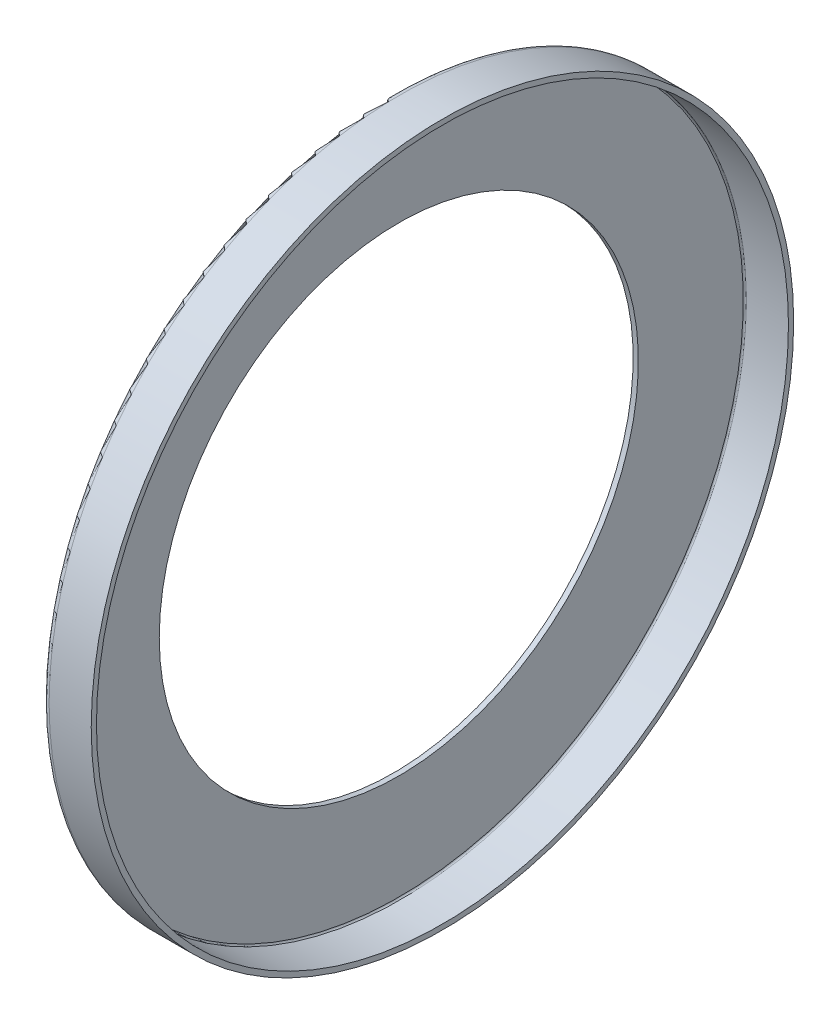
ISO-10303-21;
HEADER;
FILE_DESCRIPTION(('STEP AP214'),'2;1');
FILE_NAME('part.step','',(''),(''),'','','');
FILE_SCHEMA(('AUTOMOTIVE_DESIGN { 1 0 10303 214 1 1 1 1 }'));
ENDSEC;
DATA;
#1=APPLICATION_CONTEXT('core data for automotive mechanical design processes');
#2=APPLICATION_PROTOCOL_DEFINITION('international standard','automotive_design',2000,#1);
#3=PRODUCT_CONTEXT('',#1,'mechanical');
#4=PRODUCT('Part','Part','',(#3));
#5=PRODUCT_RELATED_PRODUCT_CATEGORY('part','',(#4));
#6=PRODUCT_DEFINITION_FORMATION('','',#4);
#7=PRODUCT_DEFINITION_CONTEXT('part definition',#1,'design');
#8=PRODUCT_DEFINITION('design','',#6,#7);
#9=PRODUCT_DEFINITION_SHAPE('','',#8);
#10=(LENGTH_UNIT() NAMED_UNIT(*) SI_UNIT(.MILLI.,.METRE.));
#11=(NAMED_UNIT(*) PLANE_ANGLE_UNIT() SI_UNIT($,.RADIAN.));
#12=(NAMED_UNIT(*) SI_UNIT($,.STERADIAN.) SOLID_ANGLE_UNIT());
#13=UNCERTAINTY_MEASURE_WITH_UNIT(LENGTH_MEASURE(1.E-05),#10,'distance_accuracy_value','');
#14=(GEOMETRIC_REPRESENTATION_CONTEXT(3) GLOBAL_UNCERTAINTY_ASSIGNED_CONTEXT((#13)) GLOBAL_UNIT_ASSIGNED_CONTEXT((#10,
#11,#12)) REPRESENTATION_CONTEXT('',''));
#15=CARTESIAN_POINT('',(0.,0.,0.));
#16=DIRECTION('',(0.,0.,1.));
#17=DIRECTION('',(1.,0.,0.));
#18=AXIS2_PLACEMENT_3D('',#15,#16,#17);
#19=CARTESIAN_POINT('',(-3.56875,0.,0.));
#20=DIRECTION('',(-1.,0.,0.));
#21=DIRECTION('',(0.,0.,1.));
#22=AXIS2_PLACEMENT_3D('',#19,#20,#21);
#23=CYLINDRICAL_SURFACE('',#22,15.82501);
#24=CARTESIAN_POINT('',(-3.39626,0.,0.));
#25=DIRECTION('',(1.,0.,0.));
#26=DIRECTION('',(0.,0.,1.));
#27=AXIS2_PLACEMENT_3D('',#24,#25,#26);
#28=CIRCLE('',#27,15.82501);
#29=CARTESIAN_POINT('',(-3.39626,0.,15.82501));
#30=VERTEX_POINT('',#29);
#31=EDGE_CURVE('E11',#30,#30,#28,.T.);
#32=ORIENTED_EDGE('',*,*,#31,.T.);
#33=EDGE_LOOP('',(#32));
#34=FACE_BOUND('',#33,.T.);
#35=CARTESIAN_POINT('',(-3.74124,0.,0.));
#36=DIRECTION('',(1.,0.,0.));
#37=DIRECTION('',(0.,0.,1.));
#38=AXIS2_PLACEMENT_3D('',#35,#36,#37);
#39=CIRCLE('',#38,15.82501);
#40=CARTESIAN_POINT('',(-3.74124,0.,15.82501));
#41=VERTEX_POINT('',#40);
#42=EDGE_CURVE('E62',#41,#41,#39,.T.);
#43=ORIENTED_EDGE('',*,*,#42,.F.);
#44=EDGE_LOOP('',(#43));
#45=FACE_BOUND('',#44,.T.);
#46=ADVANCED_FACE('F16',(#34,#45),#23,.F.);
#47=CARTESIAN_POINT('',(-3.39626,0.,19.2905056));
#48=DIRECTION('',(1.,0.,0.));
#49=DIRECTION('',(0.,0.,1.));
#50=AXIS2_PLACEMENT_3D('',#47,#48,#49);
#51=PLANE('',#50);
#52=CARTESIAN_POINT('',(-3.39626,0.,0.));
#53=DIRECTION('',(1.,0.,0.));
#54=DIRECTION('',(0.,0.,1.));
#55=AXIS2_PLACEMENT_3D('',#52,#53,#54);
#56=CIRCLE('',#55,22.7560012);
#57=CARTESIAN_POINT('',(-3.39626,0.,22.7560012));
#58=VERTEX_POINT('',#57);
#59=EDGE_CURVE('E25',#58,#58,#56,.T.);
#60=ORIENTED_EDGE('',*,*,#59,.T.);
#61=EDGE_LOOP('',(#60));
#62=FACE_BOUND('',#61,.T.);
#63=ORIENTED_EDGE('',*,*,#31,.F.);
#64=EDGE_LOOP('',(#63));
#65=FACE_BOUND('',#64,.T.);
#66=ADVANCED_FACE('F84',(#62,#65),#51,.T.);
#67=CARTESIAN_POINT('',(-3.296251,0.,0.));
#68=DIRECTION('',(1.,0.,0.));
#69=DIRECTION('',(0.,1.,0.));
#70=AXIS2_PLACEMENT_3D('',#67,#68,#69);
#71=TOROIDAL_SURFACE('',#70,22.7560012,0.100009);
#72=CARTESIAN_POINT('',(-3.296251,0.,0.));
#73=DIRECTION('',(1.,0.,0.));
#74=DIRECTION('',(0.,0.,1.));
#75=AXIS2_PLACEMENT_3D('',#72,#73,#74);
#76=CIRCLE('',#75,22.8560102);
#77=CARTESIAN_POINT('',(-3.296251,0.,22.8560102));
#78=VERTEX_POINT('',#77);
#79=EDGE_CURVE('E54',#78,#78,#76,.T.);
#80=ORIENTED_EDGE('',*,*,#79,.T.);
#81=EDGE_LOOP('',(#80));
#82=FACE_BOUND('',#81,.T.);
#83=ORIENTED_EDGE('',*,*,#59,.F.);
#84=EDGE_LOOP('',(#83));
#85=FACE_BOUND('',#84,.T.);
#86=ADVANCED_FACE('F55',(#82,#85),#71,.F.);
#87=CARTESIAN_POINT('',(-1.9052725,0.,0.));
#88=DIRECTION('',(-1.,0.,0.));
#89=DIRECTION('',(0.,0.,1.));
#90=AXIS2_PLACEMENT_3D('',#87,#88,#89);
#91=CYLINDRICAL_SURFACE('',#90,22.8560102);
#92=CARTESIAN_POINT('',(-0.514294,0.,0.));
#93=DIRECTION('',(1.,0.,0.));
#94=DIRECTION('',(0.,0.,1.));
#95=AXIS2_PLACEMENT_3D('',#92,#93,#94);
#96=CIRCLE('',#95,22.8560102);
#97=CARTESIAN_POINT('',(-0.514294,0.,22.8560102));
#98=VERTEX_POINT('',#97);
#99=EDGE_CURVE('E58',#98,#98,#96,.T.);
#100=ORIENTED_EDGE('',*,*,#99,.T.);
#101=EDGE_LOOP('',(#100));
#102=FACE_BOUND('',#101,.T.);
#103=ORIENTED_EDGE('',*,*,#79,.F.);
#104=EDGE_LOOP('',(#103));
#105=FACE_BOUND('',#104,.T.);
#106=ADVANCED_FACE('F18',(#102,#105),#91,.F.);
#107=CARTESIAN_POINT('',(-0.514294,0.,23.0285002));
#108=DIRECTION('',(1.,0.,0.));
#109=DIRECTION('',(0.,0.,1.));
#110=AXIS2_PLACEMENT_3D('',#107,#108,#109);
#111=PLANE('',#110);
#112=CARTESIAN_POINT('',(-0.514294,0.,0.));
#113=DIRECTION('',(1.,0.,0.));
#114=DIRECTION('',(0.,0.,1.));
#115=AXIS2_PLACEMENT_3D('',#112,#113,#114);
#116=CIRCLE('',#115,23.2009902);
#117=CARTESIAN_POINT('',(-0.514294,0.,23.2009902));
#118=VERTEX_POINT('',#117);
#119=EDGE_CURVE('E44',#118,#118,#116,.T.);
#120=ORIENTED_EDGE('',*,*,#119,.T.);
#121=EDGE_LOOP('',(#120));
#122=FACE_BOUND('',#121,.T.);
#123=ORIENTED_EDGE('',*,*,#99,.F.);
#124=EDGE_LOOP('',(#123));
#125=FACE_BOUND('',#124,.T.);
#126=ADVANCED_FACE('F93',(#122,#125),#111,.T.);
#127=CARTESIAN_POINT('',(-1.9052725,0.,0.));
#128=DIRECTION('',(-1.,0.,0.));
#129=DIRECTION('',(0.,0.,1.));
#130=AXIS2_PLACEMENT_3D('',#127,#128,#129);
#131=CYLINDRICAL_SURFACE('',#130,23.2009902);
#132=CARTESIAN_POINT('',(-3.296251,0.,0.));
#133=DIRECTION('',(1.,0.,0.));
#134=DIRECTION('',(0.,0.,1.));
#135=AXIS2_PLACEMENT_3D('',#132,#133,#134);
#136=CIRCLE('',#135,23.2009902);
#137=CARTESIAN_POINT('',(-3.296251,0.,23.2009902));
#138=VERTEX_POINT('',#137);
#139=EDGE_CURVE('E50',#138,#138,#136,.T.);
#140=ORIENTED_EDGE('',*,*,#139,.T.);
#141=EDGE_LOOP('',(#140));
#142=FACE_BOUND('',#141,.T.);
#143=ORIENTED_EDGE('',*,*,#119,.F.);
#144=EDGE_LOOP('',(#143));
#145=FACE_BOUND('',#144,.T.);
#146=ADVANCED_FACE('F81',(#142,#145),#131,.T.);
#147=CARTESIAN_POINT('',(-3.296251,0.,0.));
#148=DIRECTION('',(1.,0.,0.));
#149=DIRECTION('',(0.,1.,0.));
#150=AXIS2_PLACEMENT_3D('',#147,#148,#149);
#151=TOROIDAL_SURFACE('',#150,22.7560012,0.444989);
#152=CARTESIAN_POINT('',(-3.74124,0.,0.));
#153=DIRECTION('',(1.,0.,0.));
#154=DIRECTION('',(0.,0.,1.));
#155=AXIS2_PLACEMENT_3D('',#152,#153,#154);
#156=CIRCLE('',#155,22.7560012);
#157=CARTESIAN_POINT('',(-3.74124,0.,22.7560012));
#158=VERTEX_POINT('',#157);
#159=EDGE_CURVE('E64',#158,#158,#156,.T.);
#160=ORIENTED_EDGE('',*,*,#159,.T.);
#161=EDGE_LOOP('',(#160));
#162=FACE_BOUND('',#161,.T.);
#163=ORIENTED_EDGE('',*,*,#139,.F.);
#164=EDGE_LOOP('',(#163));
#165=FACE_BOUND('',#164,.T.);
#166=ADVANCED_FACE('F70',(#162,#165),#151,.T.);
#167=CARTESIAN_POINT('',(-3.74124,0.,19.2905056));
#168=DIRECTION('',(-1.,0.,0.));
#169=DIRECTION('',(0.,0.,-1.));
#170=AXIS2_PLACEMENT_3D('',#167,#168,#169);
#171=PLANE('',#170);
#172=ORIENTED_EDGE('',*,*,#42,.T.);
#173=EDGE_LOOP('',(#172));
#174=FACE_BOUND('',#173,.T.);
#175=ORIENTED_EDGE('',*,*,#159,.F.);
#176=EDGE_LOOP('',(#175));
#177=FACE_BOUND('',#176,.T.);
#178=ADVANCED_FACE('F73',(#174,#177),#171,.T.);
#179=CLOSED_SHELL('',(#46,#66,#86,#106,#126,#146,#166,#178));
#180=MANIFOLD_SOLID_BREP('B1',#179);
#181=ADVANCED_BREP_SHAPE_REPRESENTATION('',(#18,#180),#14);
#182=SHAPE_DEFINITION_REPRESENTATION(#9,#181);
ENDSEC;
END-ISO-10303-21;
